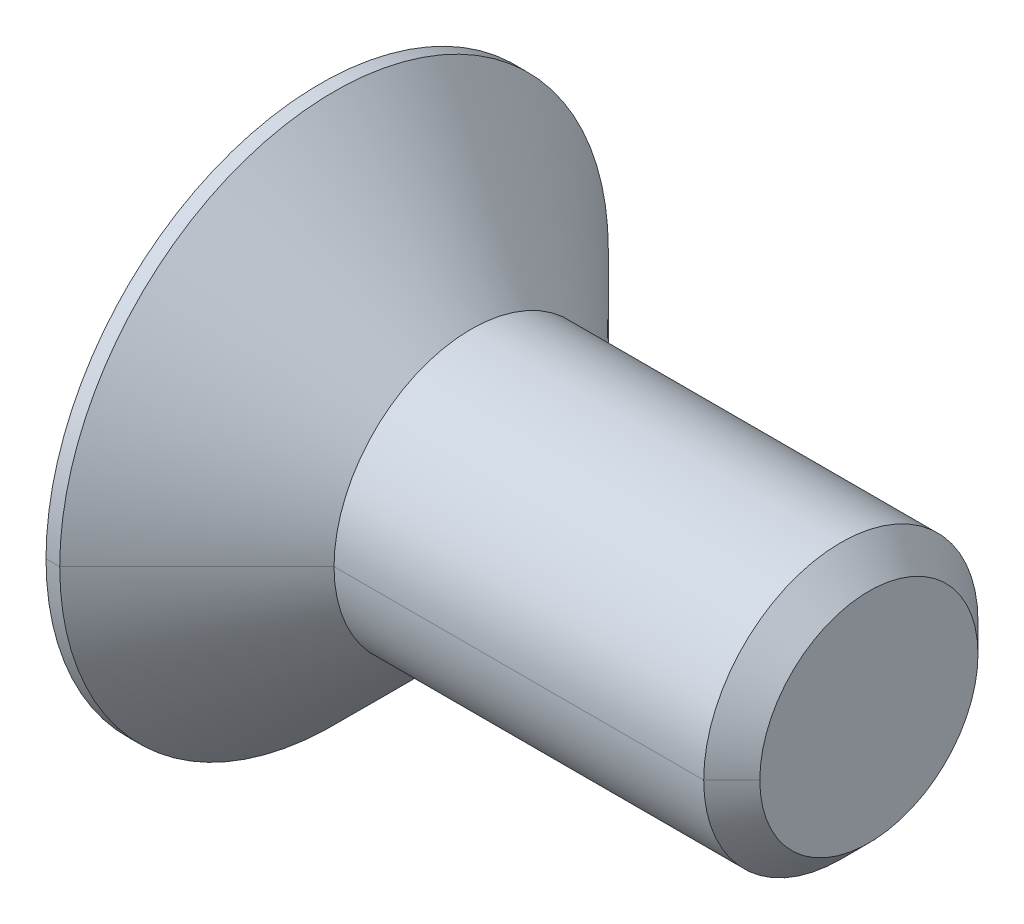
ISO-10303-21;
HEADER;
FILE_DESCRIPTION(('STEP AP214'),'2;1');
FILE_NAME('part.step','',(''),(''),'','','');
FILE_SCHEMA(('AUTOMOTIVE_DESIGN { 1 0 10303 214 1 1 1 1 }'));
ENDSEC;
DATA;
#1=APPLICATION_CONTEXT('core data for automotive mechanical design processes');
#2=APPLICATION_PROTOCOL_DEFINITION('international standard','automotive_design',2000,#1);
#3=PRODUCT_CONTEXT('',#1,'mechanical');
#4=PRODUCT('Part','Part','',(#3));
#5=PRODUCT_RELATED_PRODUCT_CATEGORY('part','',(#4));
#6=PRODUCT_DEFINITION_FORMATION('','',#4);
#7=PRODUCT_DEFINITION_CONTEXT('part definition',#1,'design');
#8=PRODUCT_DEFINITION('design','',#6,#7);
#9=PRODUCT_DEFINITION_SHAPE('','',#8);
#10=(LENGTH_UNIT() NAMED_UNIT(*) SI_UNIT(.MILLI.,.METRE.));
#11=(NAMED_UNIT(*) PLANE_ANGLE_UNIT() SI_UNIT($,.RADIAN.));
#12=(NAMED_UNIT(*) SI_UNIT($,.STERADIAN.) SOLID_ANGLE_UNIT());
#13=UNCERTAINTY_MEASURE_WITH_UNIT(LENGTH_MEASURE(1.E-05),#10,'distance_accuracy_value','');
#14=(GEOMETRIC_REPRESENTATION_CONTEXT(3) GLOBAL_UNCERTAINTY_ASSIGNED_CONTEXT((#13)) GLOBAL_UNIT_ASSIGNED_CONTEXT((#10,
#11,#12)) REPRESENTATION_CONTEXT('',''));
#15=CARTESIAN_POINT('',(0.,0.,0.));
#16=DIRECTION('',(0.,0.,1.));
#17=DIRECTION('',(1.,0.,0.));
#18=AXIS2_PLACEMENT_3D('',#15,#16,#17);
#19=CARTESIAN_POINT('',(8.7,0.,0.));
#20=DIRECTION('',(-1.,0.,0.));
#21=DIRECTION('',(0.,-1.,0.));
#22=AXIS2_PLACEMENT_3D('',#19,#20,#21);
#23=CYLINDRICAL_SURFACE('',#22,6.);
#24=CARTESIAN_POINT('',(-3.,0.,0.));
#25=DIRECTION('',(1.,0.,0.));
#26=DIRECTION('',(0.,0.,-1.));
#27=AXIS2_PLACEMENT_3D('',#24,#25,#26);
#28=CIRCLE('',#27,6.);
#29=CARTESIAN_POINT('',(-3.,0.,-6.));
#30=VERTEX_POINT('',#29);
#31=CARTESIAN_POINT('',(-3.,0.,6.));
#32=VERTEX_POINT('',#31);
#33=EDGE_CURVE('E11',#30,#32,#28,.T.);
#34=ORIENTED_EDGE('',*,*,#33,.F.);
#35=CARTESIAN_POINT('',(-3.,0.,-6.));
#36=DIRECTION('',(-1.,0.,0.));
#37=VECTOR('',#36,1.);
#38=LINE('',#35,#37);
#39=CARTESIAN_POINT('',(-3.3,0.,-6.));
#40=VERTEX_POINT('',#39);
#41=EDGE_CURVE('E26',#30,#40,#38,.T.);
#42=ORIENTED_EDGE('',*,*,#41,.T.);
#43=CARTESIAN_POINT('',(-3.3,0.,0.));
#44=DIRECTION('',(1.,0.,0.));
#45=DIRECTION('',(0.,0.,-1.));
#46=AXIS2_PLACEMENT_3D('',#43,#44,#45);
#47=CIRCLE('',#46,6.);
#48=CARTESIAN_POINT('',(-3.3,0.,6.));
#49=VERTEX_POINT('',#48);
#50=EDGE_CURVE('E538',#40,#49,#47,.T.);
#51=ORIENTED_EDGE('',*,*,#50,.T.);
#52=CARTESIAN_POINT('',(-3.,0.,6.));
#53=DIRECTION('',(-1.,0.,0.));
#54=VECTOR('',#53,1.);
#55=LINE('',#52,#54);
#56=EDGE_CURVE('E525',#32,#49,#55,.T.);
#57=ORIENTED_EDGE('',*,*,#56,.F.);
#58=EDGE_LOOP('',(#34,#42,#51,#57));
#59=FACE_BOUND('',#58,.T.);
#60=ADVANCED_FACE('F17',(#59),#23,.T.);
#61=CARTESIAN_POINT('',(8.7,0.,0.));
#62=DIRECTION('',(-1.,0.,0.));
#63=DIRECTION('',(0.,1.,0.));
#64=AXIS2_PLACEMENT_3D('',#61,#62,#63);
#65=CYLINDRICAL_SURFACE('',#64,6.);
#66=CARTESIAN_POINT('',(-3.3,0.,0.));
#67=DIRECTION('',(1.,0.,0.));
#68=DIRECTION('',(0.,0.,-1.));
#69=AXIS2_PLACEMENT_3D('',#66,#67,#68);
#70=CIRCLE('',#69,6.);
#71=EDGE_CURVE('E523',#49,#40,#70,.T.);
#72=ORIENTED_EDGE('',*,*,#71,.T.);
#73=ORIENTED_EDGE('',*,*,#41,.F.);
#74=CARTESIAN_POINT('',(-3.,0.,0.));
#75=DIRECTION('',(1.,0.,0.));
#76=DIRECTION('',(0.,0.,-1.));
#77=AXIS2_PLACEMENT_3D('',#74,#75,#76);
#78=CIRCLE('',#77,6.);
#79=EDGE_CURVE('E526',#32,#30,#78,.T.);
#80=ORIENTED_EDGE('',*,*,#79,.F.);
#81=ORIENTED_EDGE('',*,*,#56,.T.);
#82=EDGE_LOOP('',(#72,#73,#80,#81));
#83=FACE_BOUND('',#82,.T.);
#84=ADVANCED_FACE('F500',(#83),#65,.T.);
#85=CARTESIAN_POINT('',(-3.,0.,0.));
#86=DIRECTION('',(-1.,0.,0.));
#87=DIRECTION('',(0.,1.,0.));
#88=AXIS2_PLACEMENT_3D('',#85,#86,#87);
#89=CONICAL_SURFACE('',#88,6.,0.785398163397449);
#90=ORIENTED_EDGE('',*,*,#79,.T.);
#91=CARTESIAN_POINT('',(0.,0.,-3.));
#92=DIRECTION('',(-0.707106781186547,0.,-0.707106781186548));
#93=VECTOR('',#92,1.);
#94=LINE('',#91,#93);
#95=CARTESIAN_POINT('',(0.,0.,-3.));
#96=VERTEX_POINT('',#95);
#97=EDGE_CURVE('E465',#96,#30,#94,.T.);
#98=ORIENTED_EDGE('',*,*,#97,.F.);
#99=CARTESIAN_POINT('',(0.,0.,0.));
#100=DIRECTION('',(1.,0.,0.));
#101=DIRECTION('',(0.,0.,-1.));
#102=AXIS2_PLACEMENT_3D('',#99,#100,#101);
#103=CIRCLE('',#102,3.);
#104=CARTESIAN_POINT('',(0.,0.,3.));
#105=VERTEX_POINT('',#104);
#106=EDGE_CURVE('E482',#105,#96,#103,.T.);
#107=ORIENTED_EDGE('',*,*,#106,.F.);
#108=CARTESIAN_POINT('',(0.,0.,3.));
#109=DIRECTION('',(-0.707106781186547,0.,0.707106781186548));
#110=VECTOR('',#109,1.);
#111=LINE('',#108,#110);
#112=EDGE_CURVE('E467',#105,#32,#111,.T.);
#113=ORIENTED_EDGE('',*,*,#112,.T.);
#114=EDGE_LOOP('',(#90,#98,#107,#113));
#115=FACE_BOUND('',#114,.T.);
#116=ADVANCED_FACE('F450',(#115),#89,.T.);
#117=CARTESIAN_POINT('',(-3.,0.,0.));
#118=DIRECTION('',(-1.,0.,0.));
#119=DIRECTION('',(0.,-1.,0.));
#120=AXIS2_PLACEMENT_3D('',#117,#118,#119);
#121=CONICAL_SURFACE('',#120,6.,0.785398163397449);
#122=CARTESIAN_POINT('',(0.,0.,0.));
#123=DIRECTION('',(1.,0.,0.));
#124=DIRECTION('',(0.,0.,-1.));
#125=AXIS2_PLACEMENT_3D('',#122,#123,#124);
#126=CIRCLE('',#125,3.);
#127=EDGE_CURVE('E433',#96,#105,#126,.T.);
#128=ORIENTED_EDGE('',*,*,#127,.F.);
#129=ORIENTED_EDGE('',*,*,#97,.T.);
#130=ORIENTED_EDGE('',*,*,#33,.T.);
#131=ORIENTED_EDGE('',*,*,#112,.F.);
#132=EDGE_LOOP('',(#128,#129,#130,#131));
#133=FACE_BOUND('',#132,.T.);
#134=ADVANCED_FACE('F441',(#133),#121,.T.);
#135=CARTESIAN_POINT('',(8.7,0.,0.));
#136=DIRECTION('',(-1.,0.,0.));
#137=DIRECTION('',(0.,-1.,0.));
#138=AXIS2_PLACEMENT_3D('',#135,#136,#137);
#139=CYLINDRICAL_SURFACE('',#138,3.);
#140=CARTESIAN_POINT('',(8.0865,0.,0.));
#141=DIRECTION('',(1.,0.,0.));
#142=DIRECTION('',(0.,0.,-1.));
#143=AXIS2_PLACEMENT_3D('',#140,#141,#142);
#144=CIRCLE('',#143,3.);
#145=CARTESIAN_POINT('',(8.0865,0.,-3.));
#146=VERTEX_POINT('',#145);
#147=CARTESIAN_POINT('',(8.0865,0.,3.));
#148=VERTEX_POINT('',#147);
#149=EDGE_CURVE('E431',#146,#148,#144,.T.);
#150=ORIENTED_EDGE('',*,*,#149,.F.);
#151=CARTESIAN_POINT('',(8.0865,0.,-3.));
#152=DIRECTION('',(-1.,0.,0.));
#153=VECTOR('',#152,1.);
#154=LINE('',#151,#153);
#155=EDGE_CURVE('E409',#146,#96,#154,.T.);
#156=ORIENTED_EDGE('',*,*,#155,.T.);
#157=ORIENTED_EDGE('',*,*,#127,.T.);
#158=CARTESIAN_POINT('',(8.0865,0.,3.));
#159=DIRECTION('',(-1.,0.,0.));
#160=VECTOR('',#159,1.);
#161=LINE('',#158,#160);
#162=EDGE_CURVE('E421',#148,#105,#161,.T.);
#163=ORIENTED_EDGE('',*,*,#162,.F.);
#164=EDGE_LOOP('',(#150,#156,#157,#163));
#165=FACE_BOUND('',#164,.T.);
#166=ADVANCED_FACE('F388',(#165),#139,.T.);
#167=CARTESIAN_POINT('',(8.7,0.,0.));
#168=DIRECTION('',(-1.,0.,0.));
#169=DIRECTION('',(0.,1.,0.));
#170=AXIS2_PLACEMENT_3D('',#167,#168,#169);
#171=CYLINDRICAL_SURFACE('',#170,3.);
#172=ORIENTED_EDGE('',*,*,#106,.T.);
#173=ORIENTED_EDGE('',*,*,#155,.F.);
#174=CARTESIAN_POINT('',(8.0865,0.,0.));
#175=DIRECTION('',(1.,0.,0.));
#176=DIRECTION('',(0.,0.,-1.));
#177=AXIS2_PLACEMENT_3D('',#174,#175,#176);
#178=CIRCLE('',#177,3.);
#179=EDGE_CURVE('E831',#148,#146,#178,.T.);
#180=ORIENTED_EDGE('',*,*,#179,.F.);
#181=ORIENTED_EDGE('',*,*,#162,.T.);
#182=EDGE_LOOP('',(#172,#173,#180,#181));
#183=FACE_BOUND('',#182,.T.);
#184=ADVANCED_FACE('F379',(#183),#171,.T.);
#185=CARTESIAN_POINT('',(8.0865,0.,0.));
#186=DIRECTION('',(-1.,0.,0.));
#187=DIRECTION('',(0.,1.,0.));
#188=AXIS2_PLACEMENT_3D('',#185,#186,#187);
#189=CONICAL_SURFACE('',#188,3.,0.785398163397449);
#190=ORIENTED_EDGE('',*,*,#179,.T.);
#191=CARTESIAN_POINT('',(8.7,0.,-2.3865));
#192=DIRECTION('',(-0.707106781186547,0.,-0.707106781186548));
#193=VECTOR('',#192,1.);
#194=LINE('',#191,#193);
#195=CARTESIAN_POINT('',(8.7,0.,-2.3865));
#196=VERTEX_POINT('',#195);
#197=EDGE_CURVE('E342',#196,#146,#194,.T.);
#198=ORIENTED_EDGE('',*,*,#197,.F.);
#199=CARTESIAN_POINT('',(8.7,0.,0.));
#200=DIRECTION('',(1.,0.,0.));
#201=DIRECTION('',(0.,0.,-1.));
#202=AXIS2_PLACEMENT_3D('',#199,#200,#201);
#203=CIRCLE('',#202,2.3865);
#204=CARTESIAN_POINT('',(8.7,0.,2.3865));
#205=VERTEX_POINT('',#204);
#206=EDGE_CURVE('E360',#205,#196,#203,.T.);
#207=ORIENTED_EDGE('',*,*,#206,.F.);
#208=CARTESIAN_POINT('',(8.7,0.,2.3865));
#209=DIRECTION('',(-0.707106781186547,0.,0.707106781186548));
#210=VECTOR('',#209,1.);
#211=LINE('',#208,#210);
#212=EDGE_CURVE('E345',#205,#148,#211,.T.);
#213=ORIENTED_EDGE('',*,*,#212,.T.);
#214=EDGE_LOOP('',(#190,#198,#207,#213));
#215=FACE_BOUND('',#214,.T.);
#216=ADVANCED_FACE('F324',(#215),#189,.T.);
#217=CARTESIAN_POINT('',(8.0865,0.,0.));
#218=DIRECTION('',(-1.,0.,0.));
#219=DIRECTION('',(0.,-1.,0.));
#220=AXIS2_PLACEMENT_3D('',#217,#218,#219);
#221=CONICAL_SURFACE('',#220,3.,0.785398163397449);
#222=CARTESIAN_POINT('',(8.7,0.,0.));
#223=DIRECTION('',(1.,0.,0.));
#224=DIRECTION('',(0.,0.,-1.));
#225=AXIS2_PLACEMENT_3D('',#222,#223,#224);
#226=CIRCLE('',#225,2.3865);
#227=EDGE_CURVE('E304',#196,#205,#226,.T.);
#228=ORIENTED_EDGE('',*,*,#227,.F.);
#229=ORIENTED_EDGE('',*,*,#197,.T.);
#230=ORIENTED_EDGE('',*,*,#149,.T.);
#231=ORIENTED_EDGE('',*,*,#212,.F.);
#232=EDGE_LOOP('',(#228,#229,#230,#231));
#233=FACE_BOUND('',#232,.T.);
#234=ADVANCED_FACE('F313',(#233),#221,.T.);
#235=CARTESIAN_POINT('',(8.7,2.3865,0.));
#236=DIRECTION('',(-1.,0.,0.));
#237=DIRECTION('',(0.,0.,1.));
#238=AXIS2_PLACEMENT_3D('',#235,#236,#237);
#239=PLANE('',#238);
#240=ORIENTED_EDGE('',*,*,#227,.T.);
#241=ORIENTED_EDGE('',*,*,#206,.T.);
#242=EDGE_LOOP('',(#240,#241));
#243=FACE_BOUND('',#242,.T.);
#244=ADVANCED_FACE('F323',(#243),#239,.F.);
#245=CARTESIAN_POINT('',(-3.3,0.,0.));
#246=DIRECTION('',(1.,0.,0.));
#247=DIRECTION('',(0.,0.,-1.));
#248=AXIS2_PLACEMENT_3D('',#245,#246,#247);
#249=PLANE('',#248);
#250=ORIENTED_EDGE('',*,*,#50,.F.);
#251=ORIENTED_EDGE('',*,*,#71,.F.);
#252=EDGE_LOOP('',(#250,#251));
#253=FACE_BOUND('',#252,.T.);
#254=DIRECTION('',(0.,0.499999999999983,-0.866025403784448));
#255=VECTOR('',#254,1.);
#256=CARTESIAN_POINT('',(-3.3,-2.3094010767585,0.));
#257=LINE('',#256,#255);
#258=CARTESIAN_POINT('',(-3.3,-2.3094010767585,0.));
#259=VERTEX_POINT('',#258);
#260=CARTESIAN_POINT('',(-3.3,-1.1547005383793,-2.));
#261=VERTEX_POINT('',#260);
#262=EDGE_CURVE('E300',#259,#261,#257,.T.);
#263=ORIENTED_EDGE('',*,*,#262,.T.);
#264=DIRECTION('',(0.,1.,0.));
#265=VECTOR('',#264,1.);
#266=CARTESIAN_POINT('',(-3.3,-1.1547005383793,-2.));
#267=LINE('',#266,#265);
#268=CARTESIAN_POINT('',(-3.3,1.1547005383793,-2.));
#269=VERTEX_POINT('',#268);
#270=EDGE_CURVE('E296',#261,#269,#267,.T.);
#271=ORIENTED_EDGE('',*,*,#270,.T.);
#272=DIRECTION('',(0.,0.499999999999983,0.866025403784448));
#273=VECTOR('',#272,1.);
#274=CARTESIAN_POINT('',(-3.3,1.1547005383793,-2.));
#275=LINE('',#274,#273);
#276=CARTESIAN_POINT('',(-3.3,2.3094010767585,0.));
#277=VERTEX_POINT('',#276);
#278=EDGE_CURVE('E292',#269,#277,#275,.T.);
#279=ORIENTED_EDGE('',*,*,#278,.T.);
#280=DIRECTION('',(0.,-0.499999999999983,0.866025403784448));
#281=VECTOR('',#280,1.);
#282=CARTESIAN_POINT('',(-3.3,2.3094010767585,0.));
#283=LINE('',#282,#281);
#284=CARTESIAN_POINT('',(-3.3,1.1547005383793,2.));
#285=VERTEX_POINT('',#284);
#286=EDGE_CURVE('E288',#277,#285,#283,.T.);
#287=ORIENTED_EDGE('',*,*,#286,.T.);
#288=DIRECTION('',(0.,-1.,0.));
#289=VECTOR('',#288,1.);
#290=CARTESIAN_POINT('',(-3.3,1.1547005383793,2.));
#291=LINE('',#290,#289);
#292=CARTESIAN_POINT('',(-3.3,-1.1547005383793,2.));
#293=VERTEX_POINT('',#292);
#294=EDGE_CURVE('E284',#285,#293,#291,.T.);
#295=ORIENTED_EDGE('',*,*,#294,.T.);
#296=DIRECTION('',(0.,-0.499999999999983,-0.866025403784448));
#297=VECTOR('',#296,1.);
#298=CARTESIAN_POINT('',(-3.3,-1.1547005383793,2.));
#299=LINE('',#298,#297);
#300=EDGE_CURVE('E280',#293,#259,#299,.T.);
#301=ORIENTED_EDGE('',*,*,#300,.T.);
#302=EDGE_LOOP('',(#263,#271,#279,#287,#295,#301));
#303=FACE_BOUND('',#302,.T.);
#304=ADVANCED_FACE('F552',(#253,#303),#249,.F.);
#305=CARTESIAN_POINT('',(-0.66,-1.1547005383793,2.));
#306=DIRECTION('',(0.,0.866025403784448,-0.499999999999983));
#307=DIRECTION('',(0.,0.499999999999983,0.866025403784448));
#308=AXIS2_PLACEMENT_3D('',#305,#306,#307);
#309=PLANE('',#308);
#310=ORIENTED_EDGE('',*,*,#300,.F.);
#311=DIRECTION('',(-1.,0.,0.));
#312=VECTOR('',#311,1.);
#313=CARTESIAN_POINT('',(-0.66,-1.1547005383793,2.));
#314=LINE('',#313,#312);
#315=CARTESIAN_POINT('',(-0.66,-1.1547005383793,2.));
#316=VERTEX_POINT('',#315);
#317=EDGE_CURVE('E275',#316,#293,#314,.T.);
#318=ORIENTED_EDGE('',*,*,#317,.F.);
#319=DIRECTION('',(0.,-0.499999999999983,-0.866025403784448));
#320=VECTOR('',#319,1.);
#321=CARTESIAN_POINT('',(-0.66,-1.1547005383793,2.));
#322=LINE('',#321,#320);
#323=CARTESIAN_POINT('',(-0.66,-1.73205080756891,0.999999999999976));
#324=VERTEX_POINT('',#323);
#325=EDGE_CURVE('E271',#316,#324,#322,.T.);
#326=ORIENTED_EDGE('',*,*,#325,.T.);
#327=DIRECTION('',(0.,-0.499999999999983,-0.866025403784448));
#328=VECTOR('',#327,1.);
#329=CARTESIAN_POINT('',(-0.66,-1.1547005383793,2.));
#330=LINE('',#329,#328);
#331=CARTESIAN_POINT('',(-0.66,-2.3094010767585,0.));
#332=VERTEX_POINT('',#331);
#333=EDGE_CURVE('E267',#324,#332,#330,.T.);
#334=ORIENTED_EDGE('',*,*,#333,.T.);
#335=DIRECTION('',(-1.,0.,0.));
#336=VECTOR('',#335,1.);
#337=CARTESIAN_POINT('',(-0.66,-2.3094010767585,0.));
#338=LINE('',#337,#336);
#339=EDGE_CURVE('E262',#332,#259,#338,.T.);
#340=ORIENTED_EDGE('',*,*,#339,.T.);
#341=EDGE_LOOP('',(#310,#318,#326,#334,#340));
#342=FACE_BOUND('',#341,.T.);
#343=ADVANCED_FACE('F555',(#342),#309,.T.);
#344=CARTESIAN_POINT('',(-0.66,-2.3094010767585,0.));
#345=DIRECTION('',(0.,0.866025403784448,0.499999999999983));
#346=DIRECTION('',(0.,-0.499999999999983,0.866025403784448));
#347=AXIS2_PLACEMENT_3D('',#344,#345,#346);
#348=PLANE('',#347);
#349=ORIENTED_EDGE('',*,*,#262,.F.);
#350=ORIENTED_EDGE('',*,*,#339,.F.);
#351=DIRECTION('',(0.,0.499999999999983,-0.866025403784448));
#352=VECTOR('',#351,1.);
#353=CARTESIAN_POINT('',(-0.66,-2.3094010767585,0.));
#354=LINE('',#353,#352);
#355=CARTESIAN_POINT('',(-0.66,-1.7320508075689,-0.999999999999966));
#356=VERTEX_POINT('',#355);
#357=EDGE_CURVE('E258',#332,#356,#354,.T.);
#358=ORIENTED_EDGE('',*,*,#357,.T.);
#359=DIRECTION('',(0.,0.499999999999983,-0.866025403784448));
#360=VECTOR('',#359,1.);
#361=CARTESIAN_POINT('',(-0.66,-2.3094010767585,0.));
#362=LINE('',#361,#360);
#363=CARTESIAN_POINT('',(-0.66,-1.1547005383793,-2.));
#364=VERTEX_POINT('',#363);
#365=EDGE_CURVE('E254',#356,#364,#362,.T.);
#366=ORIENTED_EDGE('',*,*,#365,.T.);
#367=DIRECTION('',(-1.,0.,0.));
#368=VECTOR('',#367,1.);
#369=CARTESIAN_POINT('',(-0.66,-1.1547005383793,-2.));
#370=LINE('',#369,#368);
#371=EDGE_CURVE('E249',#364,#261,#370,.T.);
#372=ORIENTED_EDGE('',*,*,#371,.T.);
#373=EDGE_LOOP('',(#349,#350,#358,#366,#372));
#374=FACE_BOUND('',#373,.T.);
#375=ADVANCED_FACE('F562',(#374),#348,.T.);
#376=CARTESIAN_POINT('',(-0.66,-1.1547005383793,-2.));
#377=DIRECTION('',(0.,0.,1.));
#378=DIRECTION('',(1.,0.,0.));
#379=AXIS2_PLACEMENT_3D('',#376,#377,#378);
#380=PLANE('',#379);
#381=ORIENTED_EDGE('',*,*,#270,.F.);
#382=ORIENTED_EDGE('',*,*,#371,.F.);
#383=DIRECTION('',(0.,1.,0.));
#384=VECTOR('',#383,1.);
#385=CARTESIAN_POINT('',(-0.66,-1.1547005383793,-2.));
#386=LINE('',#385,#384);
#387=CARTESIAN_POINT('',(-0.66,0.,-2.));
#388=VERTEX_POINT('',#387);
#389=EDGE_CURVE('E245',#364,#388,#386,.T.);
#390=ORIENTED_EDGE('',*,*,#389,.T.);
#391=DIRECTION('',(0.,1.,0.));
#392=VECTOR('',#391,1.);
#393=CARTESIAN_POINT('',(-0.66,-1.1547005383793,-2.));
#394=LINE('',#393,#392);
#395=CARTESIAN_POINT('',(-0.66,1.1547005383793,-2.));
#396=VERTEX_POINT('',#395);
#397=EDGE_CURVE('E241',#388,#396,#394,.T.);
#398=ORIENTED_EDGE('',*,*,#397,.T.);
#399=DIRECTION('',(-1.,0.,0.));
#400=VECTOR('',#399,1.);
#401=CARTESIAN_POINT('',(-0.66,1.1547005383793,-2.));
#402=LINE('',#401,#400);
#403=EDGE_CURVE('E236',#396,#269,#402,.T.);
#404=ORIENTED_EDGE('',*,*,#403,.T.);
#405=EDGE_LOOP('',(#381,#382,#390,#398,#404));
#406=FACE_BOUND('',#405,.T.);
#407=ADVANCED_FACE('F566',(#406),#380,.T.);
#408=CARTESIAN_POINT('',(-0.66,1.1547005383793,-2.));
#409=DIRECTION('',(0.,-0.866025403784448,0.499999999999983));
#410=DIRECTION('',(0.,-0.499999999999983,-0.866025403784448));
#411=AXIS2_PLACEMENT_3D('',#408,#409,#410);
#412=PLANE('',#411);
#413=ORIENTED_EDGE('',*,*,#278,.F.);
#414=ORIENTED_EDGE('',*,*,#403,.F.);
#415=DIRECTION('',(0.,0.499999999999983,0.866025403784448));
#416=VECTOR('',#415,1.);
#417=CARTESIAN_POINT('',(-0.66,1.1547005383793,-2.));
#418=LINE('',#417,#416);
#419=CARTESIAN_POINT('',(-0.66,1.73205080756891,-0.999999999999976));
#420=VERTEX_POINT('',#419);
#421=EDGE_CURVE('E232',#396,#420,#418,.T.);
#422=ORIENTED_EDGE('',*,*,#421,.T.);
#423=DIRECTION('',(0.,0.499999999999983,0.866025403784448));
#424=VECTOR('',#423,1.);
#425=CARTESIAN_POINT('',(-0.66,1.1547005383793,-2.));
#426=LINE('',#425,#424);
#427=CARTESIAN_POINT('',(-0.66,2.3094010767585,0.));
#428=VERTEX_POINT('',#427);
#429=EDGE_CURVE('E228',#420,#428,#426,.T.);
#430=ORIENTED_EDGE('',*,*,#429,.T.);
#431=DIRECTION('',(-1.,0.,0.));
#432=VECTOR('',#431,1.);
#433=CARTESIAN_POINT('',(-0.66,2.3094010767585,0.));
#434=LINE('',#433,#432);
#435=EDGE_CURVE('E223',#428,#277,#434,.T.);
#436=ORIENTED_EDGE('',*,*,#435,.T.);
#437=EDGE_LOOP('',(#413,#414,#422,#430,#436));
#438=FACE_BOUND('',#437,.T.);
#439=ADVANCED_FACE('F571',(#438),#412,.T.);
#440=CARTESIAN_POINT('',(-0.66,2.3094010767585,0.));
#441=DIRECTION('',(0.,-0.866025403784448,-0.499999999999983));
#442=DIRECTION('',(0.,0.499999999999983,-0.866025403784448));
#443=AXIS2_PLACEMENT_3D('',#440,#441,#442);
#444=PLANE('',#443);
#445=ORIENTED_EDGE('',*,*,#286,.F.);
#446=ORIENTED_EDGE('',*,*,#435,.F.);
#447=DIRECTION('',(0.,-0.499999999999983,0.866025403784448));
#448=VECTOR('',#447,1.);
#449=CARTESIAN_POINT('',(-0.66,2.3094010767585,0.));
#450=LINE('',#449,#448);
#451=CARTESIAN_POINT('',(-0.66,1.73205080756891,0.999999999999976));
#452=VERTEX_POINT('',#451);
#453=EDGE_CURVE('E219',#428,#452,#450,.T.);
#454=ORIENTED_EDGE('',*,*,#453,.T.);
#455=DIRECTION('',(0.,-0.499999999999983,0.866025403784448));
#456=VECTOR('',#455,1.);
#457=CARTESIAN_POINT('',(-0.66,2.3094010767585,0.));
#458=LINE('',#457,#456);
#459=CARTESIAN_POINT('',(-0.66,1.1547005383793,2.));
#460=VERTEX_POINT('',#459);
#461=EDGE_CURVE('E215',#452,#460,#458,.T.);
#462=ORIENTED_EDGE('',*,*,#461,.T.);
#463=DIRECTION('',(-1.,0.,0.));
#464=VECTOR('',#463,1.);
#465=CARTESIAN_POINT('',(-0.66,1.1547005383793,2.));
#466=LINE('',#465,#464);
#467=EDGE_CURVE('E210',#460,#285,#466,.T.);
#468=ORIENTED_EDGE('',*,*,#467,.T.);
#469=EDGE_LOOP('',(#445,#446,#454,#462,#468));
#470=FACE_BOUND('',#469,.T.);
#471=ADVANCED_FACE('F577',(#470),#444,.T.);
#472=CARTESIAN_POINT('',(-0.66,1.1547005383793,2.));
#473=DIRECTION('',(0.,0.,-1.));
#474=DIRECTION('',(-1.,0.,0.));
#475=AXIS2_PLACEMENT_3D('',#472,#473,#474);
#476=PLANE('',#475);
#477=ORIENTED_EDGE('',*,*,#294,.F.);
#478=ORIENTED_EDGE('',*,*,#467,.F.);
#479=DIRECTION('',(0.,-1.,0.));
#480=VECTOR('',#479,1.);
#481=CARTESIAN_POINT('',(-0.66,1.1547005383793,2.));
#482=LINE('',#481,#480);
#483=CARTESIAN_POINT('',(-0.66,0.,2.));
#484=VERTEX_POINT('',#483);
#485=EDGE_CURVE('E206',#460,#484,#482,.T.);
#486=ORIENTED_EDGE('',*,*,#485,.T.);
#487=DIRECTION('',(0.,-1.,0.));
#488=VECTOR('',#487,1.);
#489=CARTESIAN_POINT('',(-0.66,1.1547005383793,2.));
#490=LINE('',#489,#488);
#491=EDGE_CURVE('E201',#484,#316,#490,.T.);
#492=ORIENTED_EDGE('',*,*,#491,.T.);
#493=ORIENTED_EDGE('',*,*,#317,.T.);
#494=EDGE_LOOP('',(#477,#478,#486,#492,#493));
#495=FACE_BOUND('',#494,.T.);
#496=ADVANCED_FACE('F581',(#495),#476,.T.);
#497=CARTESIAN_POINT('',(-0.66,0.,0.));
#498=DIRECTION('',(1.,0.,0.));
#499=DIRECTION('',(0.,0.,-1.));
#500=AXIS2_PLACEMENT_3D('',#497,#498,#499);
#501=PLANE('',#500);
#502=CARTESIAN_POINT('',(-0.66,0.,0.));
#503=DIRECTION('',(1.,0.,0.));
#504=DIRECTION('',(0.,0.,-1.));
#505=AXIS2_PLACEMENT_3D('',#502,#503,#504);
#506=CIRCLE('',#505,2.);
#507=EDGE_CURVE('E129',#484,#324,#506,.T.);
#508=ORIENTED_EDGE('',*,*,#507,.T.);
#509=ORIENTED_EDGE('',*,*,#325,.F.);
#510=ORIENTED_EDGE('',*,*,#491,.F.);
#511=EDGE_LOOP('',(#508,#509,#510));
#512=FACE_BOUND('',#511,.T.);
#513=ADVANCED_FACE('F178',(#512),#501,.F.);
#514=CARTESIAN_POINT('',(-0.66,0.,0.));
#515=DIRECTION('',(-1.,0.,0.));
#516=DIRECTION('',(0.,1.,0.));
#517=AXIS2_PLACEMENT_3D('',#514,#515,#516);
#518=CONICAL_SURFACE('',#517,2.,1.30899693899575);
#519=CARTESIAN_POINT('',(-0.124101615137761,0.,0.));
#520=DIRECTION('',(-0.258819045102518,0.,-0.965925826289069));
#521=VECTOR('',#520,1.);
#522=LINE('',#519,#521);
#523=CARTESIAN_POINT('',(-0.12410161513776,0.,0.));
#524=VERTEX_POINT('',#523);
#525=EDGE_CURVE('E124',#524,#388,#522,.T.);
#526=ORIENTED_EDGE('',*,*,#525,.T.);
#527=CARTESIAN_POINT('',(-0.66,0.,0.));
#528=DIRECTION('',(1.,0.,0.));
#529=DIRECTION('',(0.,0.,-1.));
#530=AXIS2_PLACEMENT_3D('',#527,#528,#529);
#531=CIRCLE('',#530,2.);
#532=EDGE_CURVE('E144',#356,#388,#531,.T.);
#533=ORIENTED_EDGE('',*,*,#532,.F.);
#534=CARTESIAN_POINT('',(-0.66,0.,0.));
#535=DIRECTION('',(1.,0.,0.));
#536=DIRECTION('',(0.,0.,-1.));
#537=AXIS2_PLACEMENT_3D('',#534,#535,#536);
#538=CIRCLE('',#537,2.);
#539=EDGE_CURVE('E134',#324,#356,#538,.T.);
#540=ORIENTED_EDGE('',*,*,#539,.F.);
#541=ORIENTED_EDGE('',*,*,#507,.F.);
#542=CARTESIAN_POINT('',(-0.124101615137761,0.,0.));
#543=DIRECTION('',(-0.258819045102518,0.,0.965925826289069));
#544=VECTOR('',#543,1.);
#545=LINE('',#542,#544);
#546=EDGE_CURVE('E119',#524,#484,#545,.T.);
#547=ORIENTED_EDGE('',*,*,#546,.F.);
#548=EDGE_LOOP('',(#526,#533,#540,#541,#547));
#549=FACE_BOUND('',#548,.T.);
#550=ADVANCED_FACE('F122',(#549),#518,.F.);
#551=CARTESIAN_POINT('',(-0.66,0.,0.));
#552=DIRECTION('',(-1.,0.,0.));
#553=DIRECTION('',(0.,-1.,0.));
#554=AXIS2_PLACEMENT_3D('',#551,#552,#553);
#555=CONICAL_SURFACE('',#554,2.,1.30899693899575);
#556=ORIENTED_EDGE('',*,*,#546,.T.);
#557=CARTESIAN_POINT('',(-0.66,0.,0.));
#558=DIRECTION('',(1.,0.,0.));
#559=DIRECTION('',(0.,0.,-1.));
#560=AXIS2_PLACEMENT_3D('',#557,#558,#559);
#561=CIRCLE('',#560,2.);
#562=EDGE_CURVE('E135',#452,#484,#561,.T.);
#563=ORIENTED_EDGE('',*,*,#562,.F.);
#564=CARTESIAN_POINT('',(-0.66,0.,0.));
#565=DIRECTION('',(1.,0.,0.));
#566=DIRECTION('',(0.,0.,-1.));
#567=AXIS2_PLACEMENT_3D('',#564,#565,#566);
#568=CIRCLE('',#567,2.);
#569=EDGE_CURVE('E151',#420,#452,#568,.T.);
#570=ORIENTED_EDGE('',*,*,#569,.F.);
#571=CARTESIAN_POINT('',(-0.66,0.,0.));
#572=DIRECTION('',(1.,0.,0.));
#573=DIRECTION('',(0.,0.,-1.));
#574=AXIS2_PLACEMENT_3D('',#571,#572,#573);
#575=CIRCLE('',#574,2.);
#576=EDGE_CURVE('E142',#388,#420,#575,.T.);
#577=ORIENTED_EDGE('',*,*,#576,.F.);
#578=ORIENTED_EDGE('',*,*,#525,.F.);
#579=EDGE_LOOP('',(#556,#563,#570,#577,#578));
#580=FACE_BOUND('',#579,.T.);
#581=ADVANCED_FACE('F139',(#580),#555,.F.);
#582=CARTESIAN_POINT('',(-0.66,0.,0.));
#583=DIRECTION('',(1.,0.,0.));
#584=DIRECTION('',(0.,0.,-1.));
#585=AXIS2_PLACEMENT_3D('',#582,#583,#584);
#586=PLANE('',#585);
#587=ORIENTED_EDGE('',*,*,#576,.T.);
#588=ORIENTED_EDGE('',*,*,#421,.F.);
#589=ORIENTED_EDGE('',*,*,#397,.F.);
#590=EDGE_LOOP('',(#587,#588,#589));
#591=FACE_BOUND('',#590,.T.);
#592=ADVANCED_FACE('F172',(#591),#586,.F.);
#593=CARTESIAN_POINT('',(-0.66,0.,0.));
#594=DIRECTION('',(1.,0.,0.));
#595=DIRECTION('',(0.,0.,-1.));
#596=AXIS2_PLACEMENT_3D('',#593,#594,#595);
#597=PLANE('',#596);
#598=ORIENTED_EDGE('',*,*,#429,.F.);
#599=ORIENTED_EDGE('',*,*,#569,.T.);
#600=ORIENTED_EDGE('',*,*,#453,.F.);
#601=EDGE_LOOP('',(#598,#599,#600));
#602=FACE_BOUND('',#601,.T.);
#603=ADVANCED_FACE('F704',(#602),#597,.F.);
#604=CARTESIAN_POINT('',(-0.66,0.,0.));
#605=DIRECTION('',(1.,0.,0.));
#606=DIRECTION('',(0.,0.,-1.));
#607=AXIS2_PLACEMENT_3D('',#604,#605,#606);
#608=PLANE('',#607);
#609=ORIENTED_EDGE('',*,*,#562,.T.);
#610=ORIENTED_EDGE('',*,*,#485,.F.);
#611=ORIENTED_EDGE('',*,*,#461,.F.);
#612=EDGE_LOOP('',(#609,#610,#611));
#613=FACE_BOUND('',#612,.T.);
#614=ADVANCED_FACE('F601',(#613),#608,.F.);
#615=CARTESIAN_POINT('',(-0.66,0.,0.));
#616=DIRECTION('',(1.,0.,0.));
#617=DIRECTION('',(0.,0.,-1.));
#618=AXIS2_PLACEMENT_3D('',#615,#616,#617);
#619=PLANE('',#618);
#620=ORIENTED_EDGE('',*,*,#539,.T.);
#621=ORIENTED_EDGE('',*,*,#357,.F.);
#622=ORIENTED_EDGE('',*,*,#333,.F.);
#623=EDGE_LOOP('',(#620,#621,#622));
#624=FACE_BOUND('',#623,.T.);
#625=ADVANCED_FACE('F589',(#624),#619,.F.);
#626=CARTESIAN_POINT('',(-0.66,0.,0.));
#627=DIRECTION('',(1.,0.,0.));
#628=DIRECTION('',(0.,0.,-1.));
#629=AXIS2_PLACEMENT_3D('',#626,#627,#628);
#630=PLANE('',#629);
#631=ORIENTED_EDGE('',*,*,#532,.T.);
#632=ORIENTED_EDGE('',*,*,#389,.F.);
#633=ORIENTED_EDGE('',*,*,#365,.F.);
#634=EDGE_LOOP('',(#631,#632,#633));
#635=FACE_BOUND('',#634,.T.);
#636=ADVANCED_FACE('F592',(#635),#630,.F.);
#637=CLOSED_SHELL('',(#60,#84,#116,#134,#166,#184,#216,#234,#244,#304,#343,#375,#407,#439,#471,
#496,#513,#550,#581,#592,#603,#614,#625,#636));
#638=MANIFOLD_SOLID_BREP('B1',#637);
#639=ADVANCED_BREP_SHAPE_REPRESENTATION('',(#18,#638),#14);
#640=SHAPE_DEFINITION_REPRESENTATION(#9,#639);
ENDSEC;
END-ISO-10303-21;
